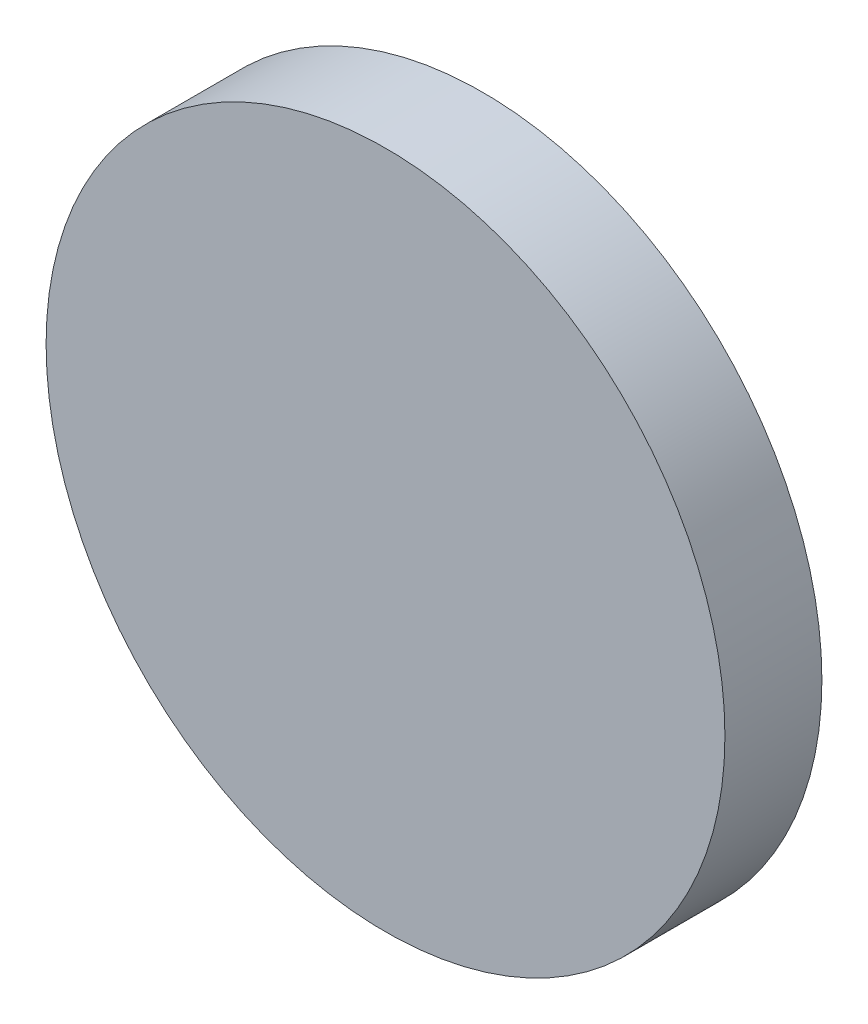
ISO-10303-21;
HEADER;
FILE_DESCRIPTION(('STEP AP214'),'2;1');
FILE_NAME('part.step','',(''),(''),'','','');
FILE_SCHEMA(('AUTOMOTIVE_DESIGN { 1 0 10303 214 1 1 1 1 }'));
ENDSEC;
DATA;
#1=APPLICATION_CONTEXT('core data for automotive mechanical design processes');
#2=APPLICATION_PROTOCOL_DEFINITION('international standard','automotive_design',2000,#1);
#3=PRODUCT_CONTEXT('',#1,'mechanical');
#4=PRODUCT('Part','Part','',(#3));
#5=PRODUCT_RELATED_PRODUCT_CATEGORY('part','',(#4));
#6=PRODUCT_DEFINITION_FORMATION('','',#4);
#7=PRODUCT_DEFINITION_CONTEXT('part definition',#1,'design');
#8=PRODUCT_DEFINITION('design','',#6,#7);
#9=PRODUCT_DEFINITION_SHAPE('','',#8);
#10=(LENGTH_UNIT() NAMED_UNIT(*) SI_UNIT(.MILLI.,.METRE.));
#11=(NAMED_UNIT(*) PLANE_ANGLE_UNIT() SI_UNIT($,.RADIAN.));
#12=(NAMED_UNIT(*) SI_UNIT($,.STERADIAN.) SOLID_ANGLE_UNIT());
#13=UNCERTAINTY_MEASURE_WITH_UNIT(LENGTH_MEASURE(1.E-05),#10,'distance_accuracy_value','');
#14=(GEOMETRIC_REPRESENTATION_CONTEXT(3) GLOBAL_UNCERTAINTY_ASSIGNED_CONTEXT((#13)) GLOBAL_UNIT_ASSIGNED_CONTEXT((#10,
#11,#12)) REPRESENTATION_CONTEXT('',''));
#15=CARTESIAN_POINT('',(0.,0.,0.));
#16=DIRECTION('',(0.,0.,1.));
#17=DIRECTION('',(1.,0.,0.));
#18=AXIS2_PLACEMENT_3D('',#15,#16,#17);
#19=CARTESIAN_POINT('',(0.,0.,0.2999994));
#20=DIRECTION('',(0.,0.,1.));
#21=DIRECTION('',(1.,0.,0.));
#22=AXIS2_PLACEMENT_3D('',#19,#20,#21);
#23=PLANE('',#22);
#24=CARTESIAN_POINT('',(0.,0.,0.2999994));
#25=DIRECTION('',(0.,0.,1.));
#26=DIRECTION('',(1.,0.,0.));
#27=AXIS2_PLACEMENT_3D('',#24,#25,#26);
#28=CIRCLE('',#27,1.05000044);
#29=CARTESIAN_POINT('',(-1.05000044,0.,0.2999994));
#30=VERTEX_POINT('',#29);
#31=EDGE_CURVE('E11',#30,#30,#28,.T.);
#32=ORIENTED_EDGE('',*,*,#31,.T.);
#33=EDGE_LOOP('',(#32));
#34=FACE_BOUND('',#33,.T.);
#35=ADVANCED_FACE('F16',(#34),#23,.T.);
#36=CARTESIAN_POINT('',(0.,0.,0.));
#37=DIRECTION('',(0.,0.,1.));
#38=DIRECTION('',(1.,0.,0.));
#39=AXIS2_PLACEMENT_3D('',#36,#37,#38);
#40=PLANE('',#39);
#41=CARTESIAN_POINT('',(0.,0.,0.));
#42=DIRECTION('',(0.,0.,1.));
#43=DIRECTION('',(1.,0.,0.));
#44=AXIS2_PLACEMENT_3D('',#41,#42,#43);
#45=CIRCLE('',#44,1.05000044);
#46=CARTESIAN_POINT('',(-1.05000044,0.,0.));
#47=VERTEX_POINT('',#46);
#48=EDGE_CURVE('E42',#47,#47,#45,.T.);
#49=ORIENTED_EDGE('',*,*,#48,.F.);
#50=EDGE_LOOP('',(#49));
#51=FACE_BOUND('',#50,.T.);
#52=ADVANCED_FACE('F18',(#51),#40,.F.);
#53=CARTESIAN_POINT('',(0.,0.,0.));
#54=DIRECTION('',(0.,0.,-1.));
#55=DIRECTION('',(1.,0.,0.));
#56=AXIS2_PLACEMENT_3D('',#53,#54,#55);
#57=CYLINDRICAL_SURFACE('',#56,1.05000044);
#58=ORIENTED_EDGE('',*,*,#48,.T.);
#59=DIRECTION('',(0.,0.,1.));
#60=VECTOR('',#59,1.);
#61=CARTESIAN_POINT('',(-1.05000044,0.,0.));
#62=LINE('',#61,#60);
#63=EDGE_CURVE('E26',#47,#30,#62,.T.);
#64=ORIENTED_EDGE('',*,*,#63,.T.);
#65=ORIENTED_EDGE('',*,*,#31,.F.);
#66=ORIENTED_EDGE('',*,*,#63,.F.);
#67=EDGE_LOOP('',(#58,#64,#65,#66));
#68=FACE_BOUND('',#67,.T.);
#69=ADVANCED_FACE('F40',(#68),#57,.T.);
#70=CLOSED_SHELL('',(#35,#52,#69));
#71=MANIFOLD_SOLID_BREP('B1',#70);
#72=ADVANCED_BREP_SHAPE_REPRESENTATION('',(#18,#71),#14);
#73=SHAPE_DEFINITION_REPRESENTATION(#9,#72);
ENDSEC;
END-ISO-10303-21;
